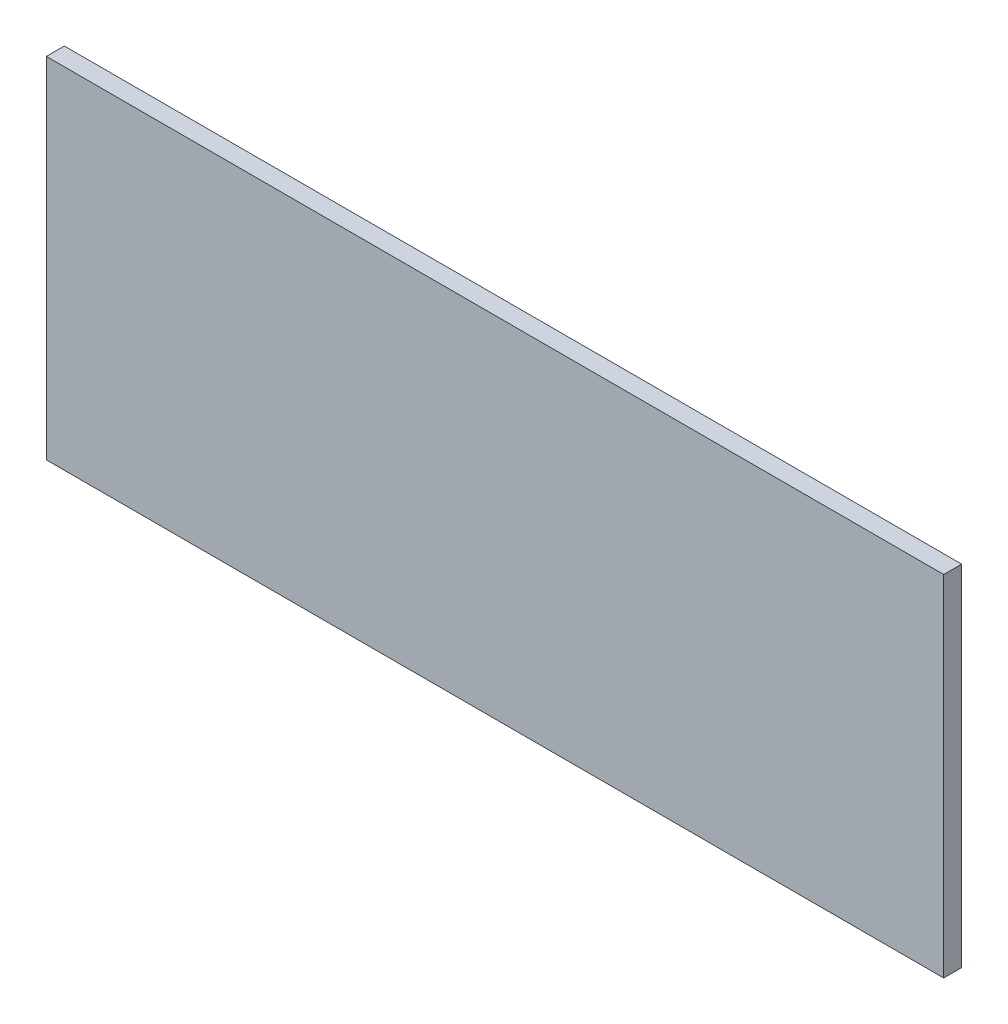
ISO-10303-21;
HEADER;
FILE_DESCRIPTION(('STEP AP214'),'2;1');
FILE_NAME('part.step','',(''),(''),'','','');
FILE_SCHEMA(('AUTOMOTIVE_DESIGN { 1 0 10303 214 1 1 1 1 }'));
ENDSEC;
DATA;
#1=APPLICATION_CONTEXT('core data for automotive mechanical design processes');
#2=APPLICATION_PROTOCOL_DEFINITION('international standard','automotive_design',2000,#1);
#3=PRODUCT_CONTEXT('',#1,'mechanical');
#4=PRODUCT('Part','Part','',(#3));
#5=PRODUCT_RELATED_PRODUCT_CATEGORY('part','',(#4));
#6=PRODUCT_DEFINITION_FORMATION('','',#4);
#7=PRODUCT_DEFINITION_CONTEXT('part definition',#1,'design');
#8=PRODUCT_DEFINITION('design','',#6,#7);
#9=PRODUCT_DEFINITION_SHAPE('','',#8);
#10=(LENGTH_UNIT() NAMED_UNIT(*) SI_UNIT(.MILLI.,.METRE.));
#11=(NAMED_UNIT(*) PLANE_ANGLE_UNIT() SI_UNIT($,.RADIAN.));
#12=(NAMED_UNIT(*) SI_UNIT($,.STERADIAN.) SOLID_ANGLE_UNIT());
#13=UNCERTAINTY_MEASURE_WITH_UNIT(LENGTH_MEASURE(1.E-05),#10,'distance_accuracy_value','');
#14=(GEOMETRIC_REPRESENTATION_CONTEXT(3) GLOBAL_UNCERTAINTY_ASSIGNED_CONTEXT((#13)) GLOBAL_UNIT_ASSIGNED_CONTEXT((#10,
#11,#12)) REPRESENTATION_CONTEXT('',''));
#15=CARTESIAN_POINT('',(0.,0.,0.));
#16=DIRECTION('',(0.,0.,1.));
#17=DIRECTION('',(1.,0.,0.));
#18=AXIS2_PLACEMENT_3D('',#15,#16,#17);
#19=CARTESIAN_POINT('',(0.,0.,5.));
#20=DIRECTION('',(1.,0.,0.));
#21=DIRECTION('',(0.,1.,0.));
#22=AXIS2_PLACEMENT_3D('',#19,#20,#21);
#23=PLANE('',#22);
#24=DIRECTION('',(0.,-1.,0.));
#25=VECTOR('',#24,1.);
#26=CARTESIAN_POINT('',(0.,0.,0.));
#27=LINE('',#26,#25);
#28=CARTESIAN_POINT('',(0.,0.,0.));
#29=VERTEX_POINT('',#28);
#30=CARTESIAN_POINT('',(1.11022302462516E-13,-97.1922331472609,0.));
#31=VERTEX_POINT('',#30);
#32=EDGE_CURVE('E96',#29,#31,#27,.T.);
#33=ORIENTED_EDGE('',*,*,#32,.T.);
#34=DIRECTION('',(0.,0.,-1.));
#35=VECTOR('',#34,1.);
#36=CARTESIAN_POINT('',(1.11022302462516E-13,-97.1922331472609,5.));
#37=LINE('',#36,#35);
#38=CARTESIAN_POINT('',(1.11022302462516E-13,-97.1922331472609,5.));
#39=VERTEX_POINT('',#38);
#40=EDGE_CURVE('E11',#39,#31,#37,.T.);
#41=ORIENTED_EDGE('',*,*,#40,.F.);
#42=DIRECTION('',(0.,-1.,0.));
#43=VECTOR('',#42,1.);
#44=CARTESIAN_POINT('',(0.,0.,5.));
#45=LINE('',#44,#43);
#46=CARTESIAN_POINT('',(0.,0.,5.));
#47=VERTEX_POINT('',#46);
#48=EDGE_CURVE('E84',#47,#39,#45,.T.);
#49=ORIENTED_EDGE('',*,*,#48,.F.);
#50=DIRECTION('',(0.,0.,-1.));
#51=VECTOR('',#50,1.);
#52=CARTESIAN_POINT('',(0.,0.,5.));
#53=LINE('',#52,#51);
#54=EDGE_CURVE('E92',#47,#29,#53,.T.);
#55=ORIENTED_EDGE('',*,*,#54,.T.);
#56=EDGE_LOOP('',(#33,#41,#49,#55));
#57=FACE_BOUND('',#56,.T.);
#58=ADVANCED_FACE('F33',(#57),#23,.F.);
#59=CARTESIAN_POINT('',(1.11022302462516E-13,-97.1922331472609,5.));
#60=DIRECTION('',(0.,1.,0.));
#61=DIRECTION('',(-1.,0.,0.));
#62=AXIS2_PLACEMENT_3D('',#59,#60,#61);
#63=PLANE('',#62);
#64=DIRECTION('',(1.,0.,0.));
#65=VECTOR('',#64,1.);
#66=CARTESIAN_POINT('',(1.11022302462516E-13,-97.1922331472609,0.));
#67=LINE('',#66,#65);
#68=CARTESIAN_POINT('',(249.6,-97.1922331472609,0.));
#69=VERTEX_POINT('',#68);
#70=EDGE_CURVE('E88',#31,#69,#67,.T.);
#71=ORIENTED_EDGE('',*,*,#70,.T.);
#72=DIRECTION('',(0.,0.,-1.));
#73=VECTOR('',#72,1.);
#74=CARTESIAN_POINT('',(249.6,-97.1922331472609,5.));
#75=LINE('',#74,#73);
#76=CARTESIAN_POINT('',(249.6,-97.1922331472609,5.));
#77=VERTEX_POINT('',#76);
#78=EDGE_CURVE('E41',#77,#69,#75,.T.);
#79=ORIENTED_EDGE('',*,*,#78,.F.);
#80=DIRECTION('',(1.,0.,0.));
#81=VECTOR('',#80,1.);
#82=CARTESIAN_POINT('',(1.11022302462516E-13,-97.1922331472609,5.));
#83=LINE('',#82,#81);
#84=EDGE_CURVE('E79',#39,#77,#83,.T.);
#85=ORIENTED_EDGE('',*,*,#84,.F.);
#86=ORIENTED_EDGE('',*,*,#40,.T.);
#87=EDGE_LOOP('',(#71,#79,#85,#86));
#88=FACE_BOUND('',#87,.T.);
#89=ADVANCED_FACE('F87',(#88),#63,.F.);
#90=CARTESIAN_POINT('',(249.6,1.38777878078145E-13,5.));
#91=DIRECTION('',(-1.,0.,0.));
#92=DIRECTION('',(0.,-1.,0.));
#93=AXIS2_PLACEMENT_3D('',#90,#91,#92);
#94=PLANE('',#93);
#95=DIRECTION('',(0.,1.,0.));
#96=VECTOR('',#95,1.);
#97=CARTESIAN_POINT('',(249.6,1.38777878078145E-13,0.));
#98=LINE('',#97,#96);
#99=CARTESIAN_POINT('',(249.6,1.38777878078145E-13,0.));
#100=VERTEX_POINT('',#99);
#101=EDGE_CURVE('E66',#69,#100,#98,.T.);
#102=ORIENTED_EDGE('',*,*,#101,.T.);
#103=DIRECTION('',(0.,0.,-1.));
#104=VECTOR('',#103,1.);
#105=CARTESIAN_POINT('',(249.6,1.38777878078145E-13,5.));
#106=LINE('',#105,#104);
#107=CARTESIAN_POINT('',(249.6,1.38777878078145E-13,5.));
#108=VERTEX_POINT('',#107);
#109=EDGE_CURVE('E89',#108,#100,#106,.T.);
#110=ORIENTED_EDGE('',*,*,#109,.F.);
#111=DIRECTION('',(0.,1.,0.));
#112=VECTOR('',#111,1.);
#113=CARTESIAN_POINT('',(249.6,1.38777878078145E-13,5.));
#114=LINE('',#113,#112);
#115=EDGE_CURVE('E82',#77,#108,#114,.T.);
#116=ORIENTED_EDGE('',*,*,#115,.F.);
#117=ORIENTED_EDGE('',*,*,#78,.T.);
#118=EDGE_LOOP('',(#102,#110,#116,#117));
#119=FACE_BOUND('',#118,.T.);
#120=ADVANCED_FACE('F90',(#119),#94,.F.);
#121=CARTESIAN_POINT('',(0.,0.,5.));
#122=DIRECTION('',(0.,-1.,0.));
#123=DIRECTION('',(1.,0.,0.));
#124=AXIS2_PLACEMENT_3D('',#121,#122,#123);
#125=PLANE('',#124);
#126=DIRECTION('',(-1.,0.,0.));
#127=VECTOR('',#126,1.);
#128=CARTESIAN_POINT('',(0.,0.,0.));
#129=LINE('',#128,#127);
#130=EDGE_CURVE('E72',#100,#29,#129,.T.);
#131=ORIENTED_EDGE('',*,*,#130,.T.);
#132=ORIENTED_EDGE('',*,*,#54,.F.);
#133=DIRECTION('',(-1.,0.,0.));
#134=VECTOR('',#133,1.);
#135=CARTESIAN_POINT('',(0.,0.,5.));
#136=LINE('',#135,#134);
#137=EDGE_CURVE('E49',#108,#47,#136,.T.);
#138=ORIENTED_EDGE('',*,*,#137,.F.);
#139=ORIENTED_EDGE('',*,*,#109,.T.);
#140=EDGE_LOOP('',(#131,#132,#138,#139));
#141=FACE_BOUND('',#140,.T.);
#142=ADVANCED_FACE('F103',(#141),#125,.F.);
#143=CARTESIAN_POINT('',(0.,0.,5.));
#144=DIRECTION('',(0.,0.,1.));
#145=DIRECTION('',(1.,0.,0.));
#146=AXIS2_PLACEMENT_3D('',#143,#144,#145);
#147=PLANE('',#146);
#148=ORIENTED_EDGE('',*,*,#48,.T.);
#149=ORIENTED_EDGE('',*,*,#84,.T.);
#150=ORIENTED_EDGE('',*,*,#115,.T.);
#151=ORIENTED_EDGE('',*,*,#137,.T.);
#152=EDGE_LOOP('',(#148,#149,#150,#151));
#153=FACE_BOUND('',#152,.T.);
#154=ADVANCED_FACE('F80',(#153),#147,.T.);
#155=CARTESIAN_POINT('',(0.,0.,0.));
#156=DIRECTION('',(0.,0.,1.));
#157=DIRECTION('',(1.,0.,0.));
#158=AXIS2_PLACEMENT_3D('',#155,#156,#157);
#159=PLANE('',#158);
#160=ORIENTED_EDGE('',*,*,#32,.F.);
#161=ORIENTED_EDGE('',*,*,#130,.F.);
#162=ORIENTED_EDGE('',*,*,#101,.F.);
#163=ORIENTED_EDGE('',*,*,#70,.F.);
#164=EDGE_LOOP('',(#160,#161,#162,#163));
#165=FACE_BOUND('',#164,.T.);
#166=ADVANCED_FACE('F106',(#165),#159,.F.);
#167=CLOSED_SHELL('',(#58,#89,#120,#142,#154,#166));
#168=MANIFOLD_SOLID_BREP('B2',#167);
#169=ADVANCED_BREP_SHAPE_REPRESENTATION('',(#18,#168),#14);
#170=SHAPE_DEFINITION_REPRESENTATION(#9,#169);
ENDSEC;
END-ISO-10303-21;
